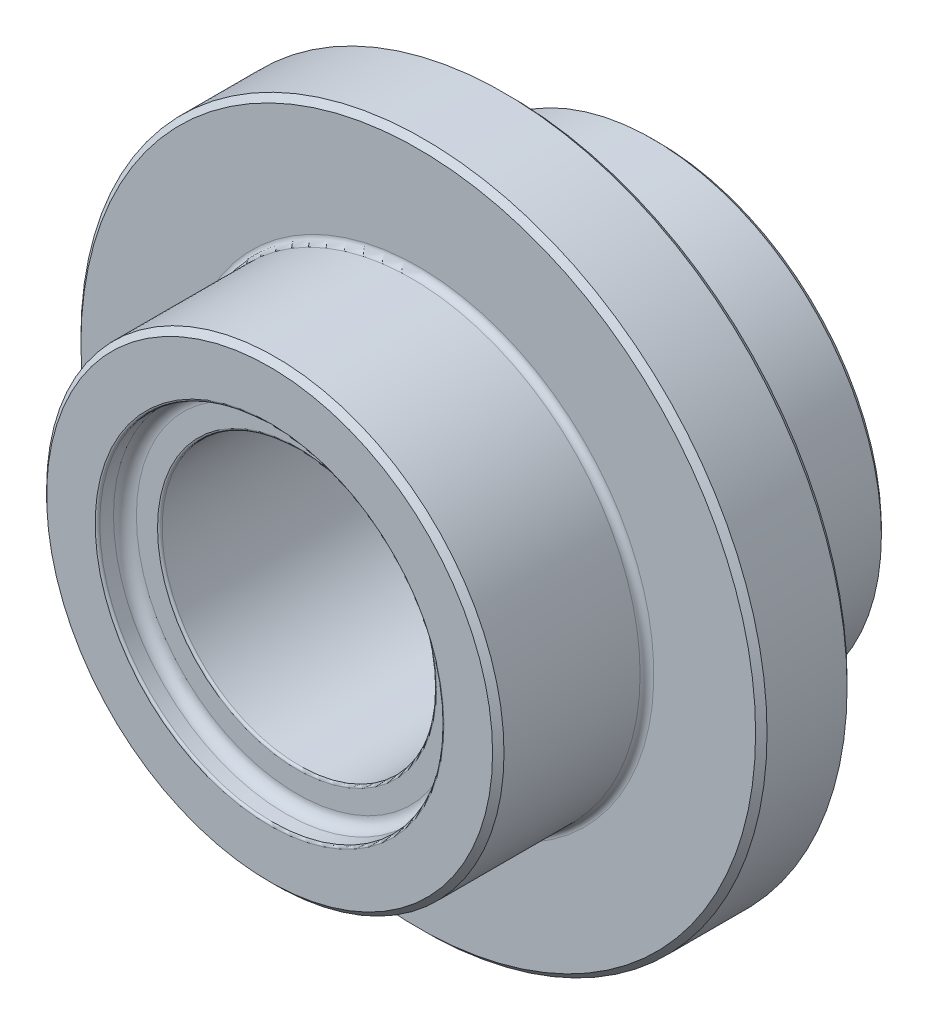
ISO-10303-21;
HEADER;
FILE_DESCRIPTION(('STEP AP214'),'2;1');
FILE_NAME('part.step','',(''),(''),'','','');
FILE_SCHEMA(('AUTOMOTIVE_DESIGN { 1 0 10303 214 1 1 1 1 }'));
ENDSEC;
DATA;
#1=APPLICATION_CONTEXT('core data for automotive mechanical design processes');
#2=APPLICATION_PROTOCOL_DEFINITION('international standard','automotive_design',2000,#1);
#3=PRODUCT_CONTEXT('',#1,'mechanical');
#4=PRODUCT('Part','Part','',(#3));
#5=PRODUCT_RELATED_PRODUCT_CATEGORY('part','',(#4));
#6=PRODUCT_DEFINITION_FORMATION('','',#4);
#7=PRODUCT_DEFINITION_CONTEXT('part definition',#1,'design');
#8=PRODUCT_DEFINITION('design','',#6,#7);
#9=PRODUCT_DEFINITION_SHAPE('','',#8);
#10=(LENGTH_UNIT() NAMED_UNIT(*) SI_UNIT(.MILLI.,.METRE.));
#11=(NAMED_UNIT(*) PLANE_ANGLE_UNIT() SI_UNIT($,.RADIAN.));
#12=(NAMED_UNIT(*) SI_UNIT($,.STERADIAN.) SOLID_ANGLE_UNIT());
#13=UNCERTAINTY_MEASURE_WITH_UNIT(LENGTH_MEASURE(1.E-05),#10,'distance_accuracy_value','');
#14=(GEOMETRIC_REPRESENTATION_CONTEXT(3) GLOBAL_UNCERTAINTY_ASSIGNED_CONTEXT((#13)) GLOBAL_UNIT_ASSIGNED_CONTEXT((#10,
#11,#12)) REPRESENTATION_CONTEXT('',''));
#15=CARTESIAN_POINT('',(0.,0.,0.));
#16=DIRECTION('',(0.,0.,1.));
#17=DIRECTION('',(1.,0.,0.));
#18=AXIS2_PLACEMENT_3D('',#15,#16,#17);
#19=CARTESIAN_POINT('',(0.,0.,-21.001));
#20=DIRECTION('',(0.,0.,1.));
#21=DIRECTION('',(1.,0.,0.));
#22=AXIS2_PLACEMENT_3D('',#19,#20,#21);
#23=CYLINDRICAL_SURFACE('',#22,12.);
#24=CARTESIAN_POINT('',(0.,0.,10.4));
#25=DIRECTION('',(0.,0.,1.));
#26=DIRECTION('',(1.,0.,0.));
#27=AXIS2_PLACEMENT_3D('',#24,#25,#26);
#28=CIRCLE('',#27,12.);
#29=CARTESIAN_POINT('',(12.,0.,10.4));
#30=VERTEX_POINT('',#29);
#31=EDGE_CURVE('E49',#30,#30,#28,.T.);
#32=ORIENTED_EDGE('',*,*,#31,.T.);
#33=EDGE_LOOP('',(#32));
#34=FACE_BOUND('',#33,.T.);
#35=CARTESIAN_POINT('',(0.,0.,-20.5));
#36=DIRECTION('',(0.,0.,-1.));
#37=DIRECTION('',(-1.,0.,0.));
#38=AXIS2_PLACEMENT_3D('',#35,#36,#37);
#39=CIRCLE('',#38,12.);
#40=CARTESIAN_POINT('',(-12.,0.,-20.5));
#41=VERTEX_POINT('',#40);
#42=EDGE_CURVE('E97',#41,#41,#39,.T.);
#43=ORIENTED_EDGE('',*,*,#42,.T.);
#44=EDGE_LOOP('',(#43));
#45=FACE_BOUND('',#44,.T.);
#46=ADVANCED_FACE('F38',(#34,#45),#23,.F.);
#47=CARTESIAN_POINT('',(0.,0.,13.));
#48=DIRECTION('',(0.,0.,-1.));
#49=DIRECTION('',(-1.,0.,0.));
#50=AXIS2_PLACEMENT_3D('',#47,#48,#49);
#51=CYLINDRICAL_SURFACE('',#50,20.);
#52=CARTESIAN_POINT('',(0.,0.,0.6));
#53=DIRECTION('',(0.,0.,-1.));
#54=DIRECTION('',(-1.,0.,0.));
#55=AXIS2_PLACEMENT_3D('',#52,#53,#54);
#56=CIRCLE('',#55,20.);
#57=CARTESIAN_POINT('',(-20.,0.,0.6));
#58=VERTEX_POINT('',#57);
#59=EDGE_CURVE('E73',#58,#58,#56,.F.);
#60=ORIENTED_EDGE('',*,*,#59,.T.);
#61=EDGE_LOOP('',(#60));
#62=FACE_BOUND('',#61,.T.);
#63=CARTESIAN_POINT('',(0.,0.,12.5));
#64=DIRECTION('',(0.,0.,1.));
#65=DIRECTION('',(1.,0.,0.));
#66=AXIS2_PLACEMENT_3D('',#63,#64,#65);
#67=CIRCLE('',#66,20.);
#68=CARTESIAN_POINT('',(20.,0.,12.5));
#69=VERTEX_POINT('',#68);
#70=EDGE_CURVE('E76',#69,#69,#67,.F.);
#71=ORIENTED_EDGE('',*,*,#70,.T.);
#72=EDGE_LOOP('',(#71));
#73=FACE_BOUND('',#72,.T.);
#74=ADVANCED_FACE('F128',(#62,#73),#51,.T.);
#75=CARTESIAN_POINT('',(0.,0.,13.));
#76=DIRECTION('',(0.,0.,1.));
#77=DIRECTION('',(1.,0.,0.));
#78=AXIS2_PLACEMENT_3D('',#75,#76,#77);
#79=PLANE('',#78);
#80=CARTESIAN_POINT('',(0.,0.,13.));
#81=DIRECTION('',(0.,0.,1.));
#82=DIRECTION('',(1.,0.,0.));
#83=AXIS2_PLACEMENT_3D('',#80,#81,#82);
#84=CIRCLE('',#83,15.25);
#85=CARTESIAN_POINT('',(15.25,0.,13.));
#86=VERTEX_POINT('',#85);
#87=EDGE_CURVE('E58',#86,#86,#84,.F.);
#88=ORIENTED_EDGE('',*,*,#87,.T.);
#89=EDGE_LOOP('',(#88));
#90=FACE_BOUND('',#89,.T.);
#91=CARTESIAN_POINT('',(0.,0.,13.));
#92=DIRECTION('',(0.,0.,1.));
#93=DIRECTION('',(1.,0.,0.));
#94=AXIS2_PLACEMENT_3D('',#91,#92,#93);
#95=CIRCLE('',#94,19.5);
#96=CARTESIAN_POINT('',(19.5,0.,13.));
#97=VERTEX_POINT('',#96);
#98=EDGE_CURVE('E79',#97,#97,#95,.T.);
#99=ORIENTED_EDGE('',*,*,#98,.T.);
#100=EDGE_LOOP('',(#99));
#101=FACE_BOUND('',#100,.T.);
#102=ADVANCED_FACE('F134',(#90,#101),#79,.T.);
#103=CARTESIAN_POINT('',(0.,0.,-8.));
#104=DIRECTION('',(0.,0.,1.));
#105=DIRECTION('',(1.,0.,0.));
#106=AXIS2_PLACEMENT_3D('',#103,#104,#105);
#107=CYLINDRICAL_SURFACE('',#106,30.);
#108=CARTESIAN_POINT('',(0.,0.,-7.49999999999999));
#109=DIRECTION('',(0.,0.,-1.));
#110=DIRECTION('',(-1.,0.,0.));
#111=AXIS2_PLACEMENT_3D('',#108,#109,#110);
#112=CIRCLE('',#111,30.);
#113=CARTESIAN_POINT('',(-30.,0.,-7.49999999999999));
#114=VERTEX_POINT('',#113);
#115=EDGE_CURVE('E85',#114,#114,#112,.F.);
#116=ORIENTED_EDGE('',*,*,#115,.T.);
#117=EDGE_LOOP('',(#116));
#118=FACE_BOUND('',#117,.T.);
#119=CARTESIAN_POINT('',(0.,0.,-0.500000000000004));
#120=DIRECTION('',(0.,0.,-1.));
#121=DIRECTION('',(-1.,0.,0.));
#122=AXIS2_PLACEMENT_3D('',#119,#120,#121);
#123=CIRCLE('',#122,30.);
#124=CARTESIAN_POINT('',(-30.,0.,-0.500000000000004));
#125=VERTEX_POINT('',#124);
#126=EDGE_CURVE('E88',#125,#125,#123,.T.);
#127=ORIENTED_EDGE('',*,*,#126,.T.);
#128=EDGE_LOOP('',(#127));
#129=FACE_BOUND('',#128,.T.);
#130=ADVANCED_FACE('F153',(#118,#129),#107,.T.);
#131=CARTESIAN_POINT('',(0.,0.,-8.));
#132=DIRECTION('',(0.,0.,-1.));
#133=DIRECTION('',(-1.,0.,0.));
#134=AXIS2_PLACEMENT_3D('',#131,#132,#133);
#135=PLANE('',#134);
#136=CARTESIAN_POINT('',(0.,0.,-8.));
#137=DIRECTION('',(0.,0.,-1.));
#138=DIRECTION('',(-1.,0.,0.));
#139=AXIS2_PLACEMENT_3D('',#136,#137,#138);
#140=CIRCLE('',#139,20.6);
#141=CARTESIAN_POINT('',(-20.6,0.,-8.));
#142=VERTEX_POINT('',#141);
#143=EDGE_CURVE('E64',#142,#142,#140,.F.);
#144=ORIENTED_EDGE('',*,*,#143,.T.);
#145=EDGE_LOOP('',(#144));
#146=FACE_BOUND('',#145,.T.);
#147=CARTESIAN_POINT('',(0.,0.,-8.));
#148=DIRECTION('',(0.,0.,-1.));
#149=DIRECTION('',(-1.,0.,0.));
#150=AXIS2_PLACEMENT_3D('',#147,#148,#149);
#151=CIRCLE('',#150,29.5);
#152=CARTESIAN_POINT('',(-29.5,0.,-8.));
#153=VERTEX_POINT('',#152);
#154=EDGE_CURVE('E91',#153,#153,#151,.T.);
#155=ORIENTED_EDGE('',*,*,#154,.T.);
#156=EDGE_LOOP('',(#155));
#157=FACE_BOUND('',#156,.T.);
#158=ADVANCED_FACE('F150',(#146,#157),#135,.T.);
#159=CARTESIAN_POINT('',(0.,0.,0.));
#160=DIRECTION('',(0.,0.,-1.));
#161=DIRECTION('',(-1.,0.,0.));
#162=AXIS2_PLACEMENT_3D('',#159,#160,#161);
#163=PLANE('',#162);
#164=CARTESIAN_POINT('',(0.,0.,0.));
#165=DIRECTION('',(0.,0.,-1.));
#166=DIRECTION('',(-1.,0.,0.));
#167=AXIS2_PLACEMENT_3D('',#164,#165,#166);
#168=CIRCLE('',#167,20.6);
#169=CARTESIAN_POINT('',(-20.6,0.,0.));
#170=VERTEX_POINT('',#169);
#171=EDGE_CURVE('E70',#170,#170,#168,.T.);
#172=ORIENTED_EDGE('',*,*,#171,.T.);
#173=EDGE_LOOP('',(#172));
#174=FACE_BOUND('',#173,.T.);
#175=CARTESIAN_POINT('',(0.,0.,0.));
#176=DIRECTION('',(0.,0.,-1.));
#177=DIRECTION('',(-1.,0.,0.));
#178=AXIS2_PLACEMENT_3D('',#175,#176,#177);
#179=CIRCLE('',#178,29.5);
#180=CARTESIAN_POINT('',(-29.5,0.,0.));
#181=VERTEX_POINT('',#180);
#182=EDGE_CURVE('E82',#181,#181,#179,.F.);
#183=ORIENTED_EDGE('',*,*,#182,.T.);
#184=EDGE_LOOP('',(#183));
#185=FACE_BOUND('',#184,.T.);
#186=ADVANCED_FACE('F148',(#174,#185),#163,.F.);
#187=CARTESIAN_POINT('',(0.,0.,-21.));
#188=DIRECTION('',(0.,0.,1.));
#189=DIRECTION('',(1.,0.,0.));
#190=AXIS2_PLACEMENT_3D('',#187,#188,#189);
#191=CYLINDRICAL_SURFACE('',#190,20.);
#192=CARTESIAN_POINT('',(0.,0.,-8.6));
#193=DIRECTION('',(0.,0.,-1.));
#194=DIRECTION('',(-1.,0.,0.));
#195=AXIS2_PLACEMENT_3D('',#192,#193,#194);
#196=CIRCLE('',#195,20.);
#197=CARTESIAN_POINT('',(-20.,0.,-8.6));
#198=VERTEX_POINT('',#197);
#199=EDGE_CURVE('E67',#198,#198,#196,.T.);
#200=ORIENTED_EDGE('',*,*,#199,.T.);
#201=EDGE_LOOP('',(#200));
#202=FACE_BOUND('',#201,.T.);
#203=CARTESIAN_POINT('',(0.,0.,-20.5));
#204=DIRECTION('',(0.,0.,-1.));
#205=DIRECTION('',(-1.,0.,0.));
#206=AXIS2_PLACEMENT_3D('',#203,#204,#205);
#207=CIRCLE('',#206,20.);
#208=CARTESIAN_POINT('',(-20.,0.,-20.5));
#209=VERTEX_POINT('',#208);
#210=EDGE_CURVE('E94',#209,#209,#207,.F.);
#211=ORIENTED_EDGE('',*,*,#210,.T.);
#212=EDGE_LOOP('',(#211));
#213=FACE_BOUND('',#212,.T.);
#214=ADVANCED_FACE('F144',(#202,#213),#191,.T.);
#215=CARTESIAN_POINT('',(0.,0.,-21.));
#216=DIRECTION('',(0.,0.,-1.));
#217=DIRECTION('',(-1.,0.,0.));
#218=AXIS2_PLACEMENT_3D('',#215,#216,#217);
#219=PLANE('',#218);
#220=CARTESIAN_POINT('',(0.,0.,-21.));
#221=DIRECTION('',(0.,0.,-1.));
#222=DIRECTION('',(-1.,0.,0.));
#223=AXIS2_PLACEMENT_3D('',#220,#221,#222);
#224=CIRCLE('',#223,12.5);
#225=CARTESIAN_POINT('',(-12.5,0.,-21.));
#226=VERTEX_POINT('',#225);
#227=EDGE_CURVE('E100',#226,#226,#224,.F.);
#228=ORIENTED_EDGE('',*,*,#227,.T.);
#229=EDGE_LOOP('',(#228));
#230=FACE_BOUND('',#229,.T.);
#231=CARTESIAN_POINT('',(0.,0.,-21.));
#232=DIRECTION('',(0.,0.,-1.));
#233=DIRECTION('',(-1.,0.,0.));
#234=AXIS2_PLACEMENT_3D('',#231,#232,#233);
#235=CIRCLE('',#234,19.5);
#236=CARTESIAN_POINT('',(-19.5,0.,-21.));
#237=VERTEX_POINT('',#236);
#238=EDGE_CURVE('E103',#237,#237,#235,.T.);
#239=ORIENTED_EDGE('',*,*,#238,.T.);
#240=EDGE_LOOP('',(#239));
#241=FACE_BOUND('',#240,.T.);
#242=ADVANCED_FACE('F107',(#230,#241),#219,.T.);
#243=CARTESIAN_POINT('',(0.,0.,10.6));
#244=DIRECTION('',(0.,0.,1.));
#245=DIRECTION('',(1.,0.,0.));
#246=AXIS2_PLACEMENT_3D('',#243,#244,#245);
#247=PLANE('',#246);
#248=CARTESIAN_POINT('',(0.,0.,10.6));
#249=DIRECTION('',(0.,0.,1.));
#250=DIRECTION('',(1.,0.,0.));
#251=AXIS2_PLACEMENT_3D('',#248,#249,#250);
#252=CIRCLE('',#251,14.05);
#253=CARTESIAN_POINT('',(14.05,0.,10.6));
#254=VERTEX_POINT('',#253);
#255=EDGE_CURVE('E45',#254,#254,#252,.T.);
#256=ORIENTED_EDGE('',*,*,#255,.T.);
#257=EDGE_LOOP('',(#256));
#258=FACE_BOUND('',#257,.T.);
#259=CARTESIAN_POINT('',(0.,0.,10.6));
#260=DIRECTION('',(0.,0.,1.));
#261=DIRECTION('',(1.,0.,0.));
#262=AXIS2_PLACEMENT_3D('',#259,#260,#261);
#263=CIRCLE('',#262,12.2);
#264=CARTESIAN_POINT('',(12.2,0.,10.6));
#265=VERTEX_POINT('',#264);
#266=EDGE_CURVE('E53',#265,#265,#263,.F.);
#267=ORIENTED_EDGE('',*,*,#266,.T.);
#268=EDGE_LOOP('',(#267));
#269=FACE_BOUND('',#268,.T.);
#270=ADVANCED_FACE('F143',(#258,#269),#247,.T.);
#271=CARTESIAN_POINT('',(0.,0.,10.6));
#272=DIRECTION('',(0.,0.,1.));
#273=DIRECTION('',(1.,0.,0.));
#274=AXIS2_PLACEMENT_3D('',#271,#272,#273);
#275=CYLINDRICAL_SURFACE('',#274,15.05);
#276=CARTESIAN_POINT('',(0.,0.,11.6));
#277=DIRECTION('',(0.,0.,1.));
#278=DIRECTION('',(1.,0.,0.));
#279=AXIS2_PLACEMENT_3D('',#276,#277,#278);
#280=CIRCLE('',#279,15.05);
#281=CARTESIAN_POINT('',(15.05,0.,11.6));
#282=VERTEX_POINT('',#281);
#283=EDGE_CURVE('E10',#282,#282,#280,.F.);
#284=ORIENTED_EDGE('',*,*,#283,.T.);
#285=EDGE_LOOP('',(#284));
#286=FACE_BOUND('',#285,.T.);
#287=CARTESIAN_POINT('',(0.,0.,12.8));
#288=DIRECTION('',(0.,0.,1.));
#289=DIRECTION('',(1.,0.,0.));
#290=AXIS2_PLACEMENT_3D('',#287,#288,#289);
#291=CIRCLE('',#290,15.05);
#292=CARTESIAN_POINT('',(15.05,0.,12.8));
#293=VERTEX_POINT('',#292);
#294=EDGE_CURVE('E61',#293,#293,#291,.T.);
#295=ORIENTED_EDGE('',*,*,#294,.T.);
#296=EDGE_LOOP('',(#295));
#297=FACE_BOUND('',#296,.T.);
#298=ADVANCED_FACE('F122',(#286,#297),#275,.F.);
#299=CARTESIAN_POINT('',(0.,0.,-21.));
#300=DIRECTION('',(0.,0.,-1.));
#301=DIRECTION('',(-1.,0.,0.));
#302=AXIS2_PLACEMENT_3D('',#299,#300,#301);
#303=CONICAL_SURFACE('',#302,12.5,0.78539816339745);
#304=ORIENTED_EDGE('',*,*,#42,.F.);
#305=EDGE_LOOP('',(#304));
#306=FACE_BOUND('',#305,.T.);
#307=ORIENTED_EDGE('',*,*,#227,.F.);
#308=EDGE_LOOP('',(#307));
#309=FACE_BOUND('',#308,.T.);
#310=ADVANCED_FACE('F112',(#306,#309),#303,.F.);
#311=CARTESIAN_POINT('',(0.,0.,-21.));
#312=DIRECTION('',(0.,0.,1.));
#313=DIRECTION('',(1.,0.,0.));
#314=AXIS2_PLACEMENT_3D('',#311,#312,#313);
#315=CONICAL_SURFACE('',#314,19.5,0.785398163397448);
#316=ORIENTED_EDGE('',*,*,#210,.F.);
#317=EDGE_LOOP('',(#316));
#318=FACE_BOUND('',#317,.T.);
#319=ORIENTED_EDGE('',*,*,#238,.F.);
#320=EDGE_LOOP('',(#319));
#321=FACE_BOUND('',#320,.T.);
#322=ADVANCED_FACE('F109',(#318,#321),#315,.T.);
#323=CARTESIAN_POINT('',(0.,0.,-8.));
#324=DIRECTION('',(0.,0.,1.));
#325=DIRECTION('',(1.,0.,0.));
#326=AXIS2_PLACEMENT_3D('',#323,#324,#325);
#327=CONICAL_SURFACE('',#326,29.5,0.785398163397441);
#328=ORIENTED_EDGE('',*,*,#115,.F.);
#329=EDGE_LOOP('',(#328));
#330=FACE_BOUND('',#329,.T.);
#331=ORIENTED_EDGE('',*,*,#154,.F.);
#332=EDGE_LOOP('',(#331));
#333=FACE_BOUND('',#332,.T.);
#334=ADVANCED_FACE('F111',(#330,#333),#327,.T.);
#335=CARTESIAN_POINT('',(0.,0.,-0.500000000000004));
#336=DIRECTION('',(0.,0.,-1.));
#337=DIRECTION('',(-1.,0.,0.));
#338=AXIS2_PLACEMENT_3D('',#335,#336,#337);
#339=CONICAL_SURFACE('',#338,30.,0.785398163397455);
#340=ORIENTED_EDGE('',*,*,#182,.F.);
#341=EDGE_LOOP('',(#340));
#342=FACE_BOUND('',#341,.T.);
#343=ORIENTED_EDGE('',*,*,#126,.F.);
#344=EDGE_LOOP('',(#343));
#345=FACE_BOUND('',#344,.T.);
#346=ADVANCED_FACE('F119',(#342,#345),#339,.T.);
#347=CARTESIAN_POINT('',(0.,0.,13.));
#348=DIRECTION('',(0.,0.,-1.));
#349=DIRECTION('',(-1.,0.,0.));
#350=AXIS2_PLACEMENT_3D('',#347,#348,#349);
#351=CONICAL_SURFACE('',#350,19.5,0.785398163397448);
#352=ORIENTED_EDGE('',*,*,#70,.F.);
#353=EDGE_LOOP('',(#352));
#354=FACE_BOUND('',#353,.T.);
#355=ORIENTED_EDGE('',*,*,#98,.F.);
#356=EDGE_LOOP('',(#355));
#357=FACE_BOUND('',#356,.T.);
#358=ADVANCED_FACE('F179',(#354,#357),#351,.T.);
#359=CARTESIAN_POINT('',(0.,0.,0.6));
#360=DIRECTION('',(0.,0.,-1.));
#361=DIRECTION('',(-1.,0.,0.));
#362=AXIS2_PLACEMENT_3D('',#359,#360,#361);
#363=TOROIDAL_SURFACE('',#362,20.6,0.6);
#364=ORIENTED_EDGE('',*,*,#171,.F.);
#365=EDGE_LOOP('',(#364));
#366=FACE_BOUND('',#365,.T.);
#367=ORIENTED_EDGE('',*,*,#59,.F.);
#368=EDGE_LOOP('',(#367));
#369=FACE_BOUND('',#368,.T.);
#370=ADVANCED_FACE('F182',(#366,#369),#363,.F.);
#371=CARTESIAN_POINT('',(0.,0.,-8.6));
#372=DIRECTION('',(0.,0.,-1.));
#373=DIRECTION('',(-1.,0.,0.));
#374=AXIS2_PLACEMENT_3D('',#371,#372,#373);
#375=TOROIDAL_SURFACE('',#374,20.6,0.6);
#376=ORIENTED_EDGE('',*,*,#143,.F.);
#377=EDGE_LOOP('',(#376));
#378=FACE_BOUND('',#377,.T.);
#379=ORIENTED_EDGE('',*,*,#199,.F.);
#380=EDGE_LOOP('',(#379));
#381=FACE_BOUND('',#380,.T.);
#382=ADVANCED_FACE('F186',(#378,#381),#375,.F.);
#383=CARTESIAN_POINT('',(0.,0.,12.8));
#384=DIRECTION('',(0.,0.,1.));
#385=DIRECTION('',(1.,0.,0.));
#386=AXIS2_PLACEMENT_3D('',#383,#384,#385);
#387=TOROIDAL_SURFACE('',#386,15.25,0.2);
#388=ORIENTED_EDGE('',*,*,#87,.F.);
#389=EDGE_LOOP('',(#388));
#390=FACE_BOUND('',#389,.T.);
#391=ORIENTED_EDGE('',*,*,#294,.F.);
#392=EDGE_LOOP('',(#391));
#393=FACE_BOUND('',#392,.T.);
#394=ADVANCED_FACE('F190',(#390,#393),#387,.T.);
#395=CARTESIAN_POINT('',(0.,0.,10.4));
#396=DIRECTION('',(0.,0.,1.));
#397=DIRECTION('',(1.,0.,0.));
#398=AXIS2_PLACEMENT_3D('',#395,#396,#397);
#399=TOROIDAL_SURFACE('',#398,12.2,0.2);
#400=ORIENTED_EDGE('',*,*,#31,.F.);
#401=EDGE_LOOP('',(#400));
#402=FACE_BOUND('',#401,.T.);
#403=ORIENTED_EDGE('',*,*,#266,.F.);
#404=EDGE_LOOP('',(#403));
#405=FACE_BOUND('',#404,.T.);
#406=ADVANCED_FACE('F193',(#402,#405),#399,.T.);
#407=CARTESIAN_POINT('',(0.,0.,11.6));
#408=DIRECTION('',(0.,0.,1.));
#409=DIRECTION('',(1.,0.,0.));
#410=AXIS2_PLACEMENT_3D('',#407,#408,#409);
#411=TOROIDAL_SURFACE('',#410,14.05,1.);
#412=ORIENTED_EDGE('',*,*,#283,.F.);
#413=EDGE_LOOP('',(#412));
#414=FACE_BOUND('',#413,.T.);
#415=ORIENTED_EDGE('',*,*,#255,.F.);
#416=EDGE_LOOP('',(#415));
#417=FACE_BOUND('',#416,.T.);
#418=ADVANCED_FACE('F40',(#414,#417),#411,.F.);
#419=CLOSED_SHELL('',(#46,#74,#102,#130,#158,#186,#214,#242,#270,#298,#310,#322,#334,#346,#358,
#370,#382,#394,#406,#418));
#420=MANIFOLD_SOLID_BREP('B2',#419);
#421=ADVANCED_BREP_SHAPE_REPRESENTATION('',(#18,#420),#14);
#422=SHAPE_DEFINITION_REPRESENTATION(#9,#421);
ENDSEC;
END-ISO-10303-21;
